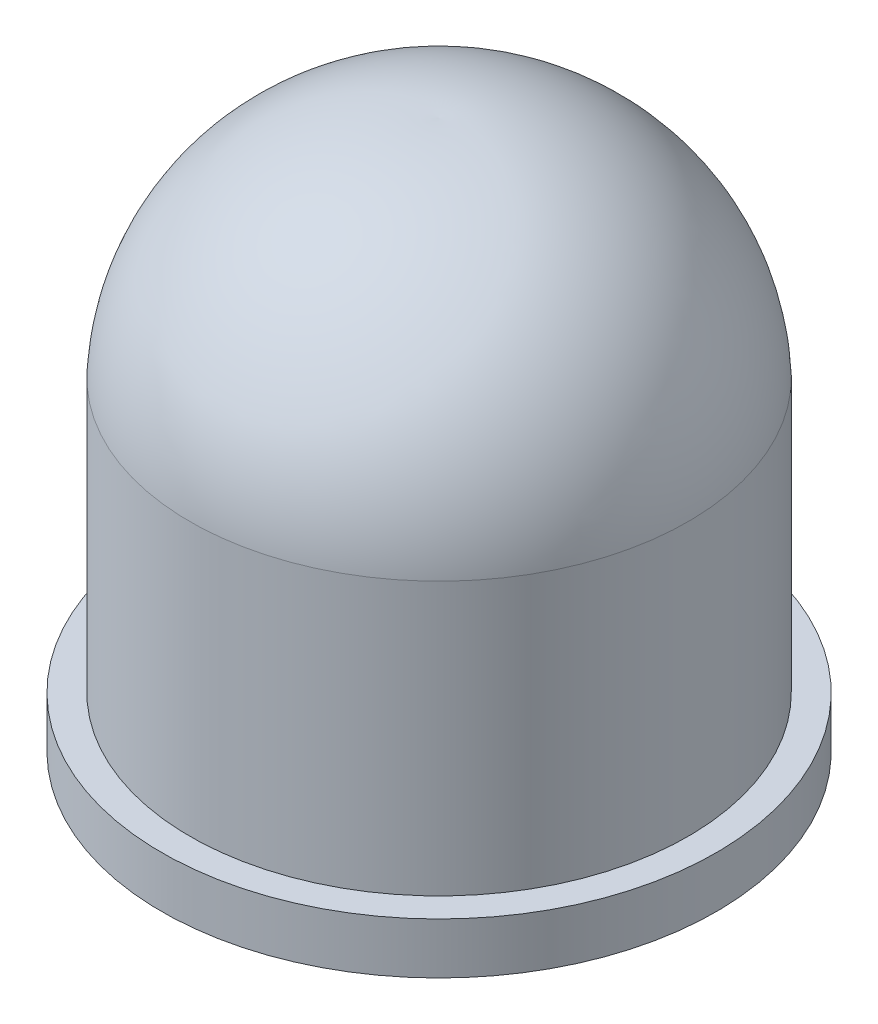
ISO-10303-21;
HEADER;
FILE_DESCRIPTION(('STEP AP214'),'2;1');
FILE_NAME('part.step','',(''),(''),'','','');
FILE_SCHEMA(('AUTOMOTIVE_DESIGN { 1 0 10303 214 1 1 1 1 }'));
ENDSEC;
DATA;
#1=APPLICATION_CONTEXT('core data for automotive mechanical design processes');
#2=APPLICATION_PROTOCOL_DEFINITION('international standard','automotive_design',2000,#1);
#3=PRODUCT_CONTEXT('',#1,'mechanical');
#4=PRODUCT('Part','Part','',(#3));
#5=PRODUCT_RELATED_PRODUCT_CATEGORY('part','',(#4));
#6=PRODUCT_DEFINITION_FORMATION('','',#4);
#7=PRODUCT_DEFINITION_CONTEXT('part definition',#1,'design');
#8=PRODUCT_DEFINITION('design','',#6,#7);
#9=PRODUCT_DEFINITION_SHAPE('','',#8);
#10=(LENGTH_UNIT() NAMED_UNIT(*) SI_UNIT(.MILLI.,.METRE.));
#11=(NAMED_UNIT(*) PLANE_ANGLE_UNIT() SI_UNIT($,.RADIAN.));
#12=(NAMED_UNIT(*) SI_UNIT($,.STERADIAN.) SOLID_ANGLE_UNIT());
#13=UNCERTAINTY_MEASURE_WITH_UNIT(LENGTH_MEASURE(1.E-05),#10,'distance_accuracy_value','');
#14=(GEOMETRIC_REPRESENTATION_CONTEXT(3) GLOBAL_UNCERTAINTY_ASSIGNED_CONTEXT((#13)) GLOBAL_UNIT_ASSIGNED_CONTEXT((#10,
#11,#12)) REPRESENTATION_CONTEXT('',''));
#15=CARTESIAN_POINT('',(0.,0.,0.));
#16=DIRECTION('',(0.,0.,1.));
#17=DIRECTION('',(1.,0.,0.));
#18=AXIS2_PLACEMENT_3D('',#15,#16,#17);
#19=CARTESIAN_POINT('',(0.,0.,0.));
#20=DIRECTION('',(0.,-1.,0.));
#21=DIRECTION('',(0.,0.,-1.));
#22=AXIS2_PLACEMENT_3D('',#19,#20,#21);
#23=PLANE('',#22);
#24=CARTESIAN_POINT('',(0.,0.,0.));
#25=DIRECTION('',(0.,-1.,0.));
#26=DIRECTION('',(0.,0.,-1.));
#27=AXIS2_PLACEMENT_3D('',#24,#25,#26);
#28=CIRCLE('',#27,2.95);
#29=CARTESIAN_POINT('',(0.,0.,-2.95));
#30=VERTEX_POINT('',#29);
#31=EDGE_CURVE('E54',#30,#30,#28,.T.);
#32=ORIENTED_EDGE('',*,*,#31,.T.);
#33=EDGE_LOOP('',(#32));
#34=FACE_BOUND('',#33,.T.);
#35=ADVANCED_FACE('F30',(#34),#23,.T.);
#36=CARTESIAN_POINT('',(0.,3.31732198026392,-0.126334819068683));
#37=DIRECTION('',(-1.,0.,0.));
#38=DIRECTION('',(0.,0.,-1.));
#39=AXIS2_PLACEMENT_3D('',#36,#37,#38);
#40=CIRCLE('',#39,2.52682536633504);
#41=TRIMMED_CURVE('',#40,(PARAMETER_VALUE(-1.6208146280919)),(PARAMETER_VALUE(1.6208146280919)),
.T.,.PARAMETER.);
#42=CARTESIAN_POINT('',(0.,3.31732198026392,0.));
#43=DIRECTION('',(0.,-1.,0.));
#44=AXIS1_PLACEMENT('',#42,#43);
#45=SURFACE_OF_REVOLUTION('',#41,#44);
#46=CARTESIAN_POINT('',(0.,5.84098716119524,0.));
#47=VERTEX_POINT('',#46);
#48=VERTEX_LOOP('',#47);
#49=FACE_BOUND('',#48,.T.);
#50=CARTESIAN_POINT('',(0.,3.44365679933261,0.));
#51=DIRECTION('',(0.,-1.,0.));
#52=DIRECTION('',(0.,0.,-1.));
#53=AXIS2_PLACEMENT_3D('',#50,#51,#52);
#54=CIRCLE('',#53,2.65);
#55=CARTESIAN_POINT('',(0.,3.44365679933261,-2.65));
#56=VERTEX_POINT('',#55);
#57=EDGE_CURVE('E11',#56,#56,#54,.T.);
#58=ORIENTED_EDGE('',*,*,#57,.F.);
#59=EDGE_LOOP('',(#58));
#60=FACE_BOUND('',#59,.T.);
#61=ADVANCED_FACE('F39',(#49,#60),#45,.T.);
#62=CARTESIAN_POINT('',(0.,0.,0.));
#63=DIRECTION('',(0.,-1.,0.));
#64=DIRECTION('',(0.,0.,-1.));
#65=AXIS2_PLACEMENT_3D('',#62,#63,#64);
#66=CYLINDRICAL_SURFACE('',#65,2.65);
#67=ORIENTED_EDGE('',*,*,#57,.T.);
#68=EDGE_LOOP('',(#67));
#69=FACE_BOUND('',#68,.T.);
#70=CARTESIAN_POINT('',(0.,0.543656799332607,0.));
#71=DIRECTION('',(0.,-1.,0.));
#72=DIRECTION('',(0.,0.,-1.));
#73=AXIS2_PLACEMENT_3D('',#70,#71,#72);
#74=CIRCLE('',#73,2.65);
#75=CARTESIAN_POINT('',(0.,0.543656799332607,-2.65));
#76=VERTEX_POINT('',#75);
#77=EDGE_CURVE('E36',#76,#76,#74,.T.);
#78=ORIENTED_EDGE('',*,*,#77,.F.);
#79=EDGE_LOOP('',(#78));
#80=FACE_BOUND('',#79,.T.);
#81=ADVANCED_FACE('F42',(#69,#80),#66,.T.);
#82=CARTESIAN_POINT('',(2.95,0.543656799332607,0.));
#83=DIRECTION('',(0.,1.,0.));
#84=DIRECTION('',(0.,0.,1.));
#85=AXIS2_PLACEMENT_3D('',#82,#83,#84);
#86=PLANE('',#85);
#87=ORIENTED_EDGE('',*,*,#77,.T.);
#88=EDGE_LOOP('',(#87));
#89=FACE_BOUND('',#88,.T.);
#90=CARTESIAN_POINT('',(0.,0.543656799332607,0.));
#91=DIRECTION('',(0.,-1.,0.));
#92=DIRECTION('',(0.,0.,-1.));
#93=AXIS2_PLACEMENT_3D('',#90,#91,#92);
#94=CIRCLE('',#93,2.95);
#95=CARTESIAN_POINT('',(0.,0.543656799332607,-2.95));
#96=VERTEX_POINT('',#95);
#97=EDGE_CURVE('E52',#96,#96,#94,.T.);
#98=ORIENTED_EDGE('',*,*,#97,.F.);
#99=EDGE_LOOP('',(#98));
#100=FACE_BOUND('',#99,.T.);
#101=ADVANCED_FACE('F47',(#89,#100),#86,.T.);
#102=CARTESIAN_POINT('',(0.,0.,0.));
#103=DIRECTION('',(0.,-1.,0.));
#104=DIRECTION('',(0.,0.,-1.));
#105=AXIS2_PLACEMENT_3D('',#102,#103,#104);
#106=CYLINDRICAL_SURFACE('',#105,2.95);
#107=ORIENTED_EDGE('',*,*,#97,.T.);
#108=EDGE_LOOP('',(#107));
#109=FACE_BOUND('',#108,.T.);
#110=ORIENTED_EDGE('',*,*,#31,.F.);
#111=EDGE_LOOP('',(#110));
#112=FACE_BOUND('',#111,.T.);
#113=ADVANCED_FACE('F61',(#109,#112),#106,.T.);
#114=CLOSED_SHELL('',(#35,#61,#81,#101,#113));
#115=MANIFOLD_SOLID_BREP('B2',#114);
#116=ADVANCED_BREP_SHAPE_REPRESENTATION('',(#18,#115),#14);
#117=SHAPE_DEFINITION_REPRESENTATION(#9,#116);
ENDSEC;
END-ISO-10303-21;
